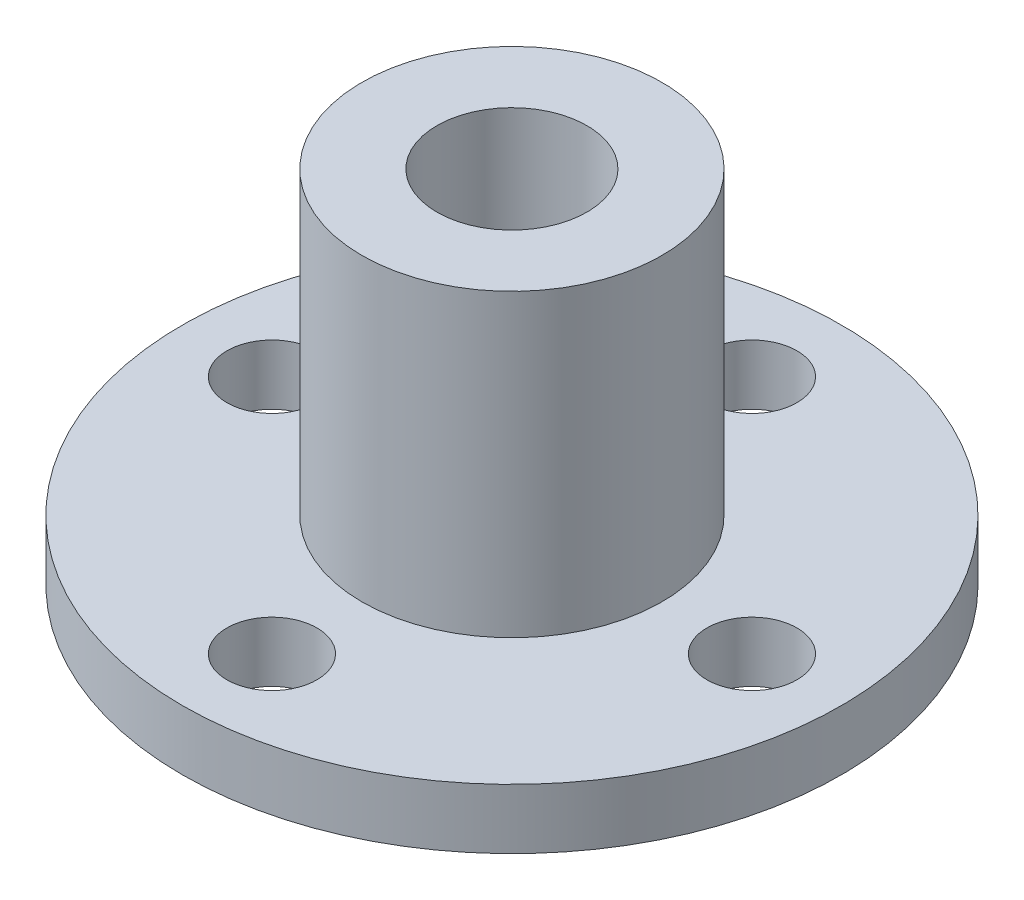
ISO-10303-21;
HEADER;
FILE_DESCRIPTION(('STEP AP214'),'2;1');
FILE_NAME('part.step','',(''),(''),'','','');
FILE_SCHEMA(('AUTOMOTIVE_DESIGN { 1 0 10303 214 1 1 1 1 }'));
ENDSEC;
DATA;
#1=APPLICATION_CONTEXT('core data for automotive mechanical design processes');
#2=APPLICATION_PROTOCOL_DEFINITION('international standard','automotive_design',2000,#1);
#3=PRODUCT_CONTEXT('',#1,'mechanical');
#4=PRODUCT('Part','Part','',(#3));
#5=PRODUCT_RELATED_PRODUCT_CATEGORY('part','',(#4));
#6=PRODUCT_DEFINITION_FORMATION('','',#4);
#7=PRODUCT_DEFINITION_CONTEXT('part definition',#1,'design');
#8=PRODUCT_DEFINITION('design','',#6,#7);
#9=PRODUCT_DEFINITION_SHAPE('','',#8);
#10=(LENGTH_UNIT() NAMED_UNIT(*) SI_UNIT(.MILLI.,.METRE.));
#11=(NAMED_UNIT(*) PLANE_ANGLE_UNIT() SI_UNIT($,.RADIAN.));
#12=(NAMED_UNIT(*) SI_UNIT($,.STERADIAN.) SOLID_ANGLE_UNIT());
#13=UNCERTAINTY_MEASURE_WITH_UNIT(LENGTH_MEASURE(1.E-05),#10,'distance_accuracy_value','');
#14=(GEOMETRIC_REPRESENTATION_CONTEXT(3) GLOBAL_UNCERTAINTY_ASSIGNED_CONTEXT((#13)) GLOBAL_UNIT_ASSIGNED_CONTEXT((#10,
#11,#12)) REPRESENTATION_CONTEXT('',''));
#15=CARTESIAN_POINT('',(0.,0.,0.));
#16=DIRECTION('',(0.,0.,1.));
#17=DIRECTION('',(1.,0.,0.));
#18=AXIS2_PLACEMENT_3D('',#15,#16,#17);
#19=CARTESIAN_POINT('',(0.,2.,0.));
#20=DIRECTION('',(0.,-1.,0.));
#21=DIRECTION('',(0.,0.,-1.));
#22=AXIS2_PLACEMENT_3D('',#19,#20,#21);
#23=CYLINDRICAL_SURFACE('',#22,10.9855);
#24=CARTESIAN_POINT('',(0.,2.,0.));
#25=DIRECTION('',(0.,1.,0.));
#26=DIRECTION('',(0.,0.,1.));
#27=AXIS2_PLACEMENT_3D('',#24,#25,#26);
#28=CIRCLE('',#27,10.9855);
#29=CARTESIAN_POINT('',(0.,2.,10.9855));
#30=VERTEX_POINT('',#29);
#31=EDGE_CURVE('E43',#30,#30,#28,.T.);
#32=ORIENTED_EDGE('',*,*,#31,.F.);
#33=EDGE_LOOP('',(#32));
#34=FACE_BOUND('',#33,.T.);
#35=CARTESIAN_POINT('',(0.,0.,0.));
#36=DIRECTION('',(0.,1.,0.));
#37=DIRECTION('',(0.,0.,1.));
#38=AXIS2_PLACEMENT_3D('',#35,#36,#37);
#39=CIRCLE('',#38,10.9855);
#40=CARTESIAN_POINT('',(0.,0.,10.9855));
#41=VERTEX_POINT('',#40);
#42=EDGE_CURVE('E48',#41,#41,#39,.T.);
#43=ORIENTED_EDGE('',*,*,#42,.T.);
#44=EDGE_LOOP('',(#43));
#45=FACE_BOUND('',#44,.T.);
#46=ADVANCED_FACE('F36',(#34,#45),#23,.T.);
#47=CARTESIAN_POINT('',(0.,2.,0.));
#48=DIRECTION('',(0.,1.,0.));
#49=DIRECTION('',(0.,0.,1.));
#50=AXIS2_PLACEMENT_3D('',#47,#48,#49);
#51=PLANE('',#50);
#52=CARTESIAN_POINT('',(8.,2.,0.));
#53=DIRECTION('',(0.,1.,0.));
#54=DIRECTION('',(0.,0.,1.));
#55=AXIS2_PLACEMENT_3D('',#52,#53,#54);
#56=CIRCLE('',#55,1.5);
#57=CARTESIAN_POINT('',(8.,2.,1.5));
#58=VERTEX_POINT('',#57);
#59=EDGE_CURVE('E60',#58,#58,#56,.T.);
#60=ORIENTED_EDGE('',*,*,#59,.F.);
#61=EDGE_LOOP('',(#60));
#62=FACE_BOUND('',#61,.T.);
#63=CARTESIAN_POINT('',(0.,2.,8.));
#64=DIRECTION('',(0.,1.,0.));
#65=DIRECTION('',(0.,0.,1.));
#66=AXIS2_PLACEMENT_3D('',#63,#64,#65);
#67=CIRCLE('',#66,1.5);
#68=CARTESIAN_POINT('',(0.,2.,9.5));
#69=VERTEX_POINT('',#68);
#70=EDGE_CURVE('E83',#69,#69,#67,.T.);
#71=ORIENTED_EDGE('',*,*,#70,.F.);
#72=EDGE_LOOP('',(#71));
#73=FACE_BOUND('',#72,.T.);
#74=CARTESIAN_POINT('',(-8.,2.,0.));
#75=DIRECTION('',(0.,1.,0.));
#76=DIRECTION('',(0.,0.,1.));
#77=AXIS2_PLACEMENT_3D('',#74,#75,#76);
#78=CIRCLE('',#77,1.5);
#79=CARTESIAN_POINT('',(-8.,2.,1.5));
#80=VERTEX_POINT('',#79);
#81=EDGE_CURVE('E80',#80,#80,#78,.T.);
#82=ORIENTED_EDGE('',*,*,#81,.F.);
#83=EDGE_LOOP('',(#82));
#84=FACE_BOUND('',#83,.T.);
#85=CARTESIAN_POINT('',(0.,2.,-8.));
#86=DIRECTION('',(0.,1.,0.));
#87=DIRECTION('',(0.,0.,1.));
#88=AXIS2_PLACEMENT_3D('',#85,#86,#87);
#89=CIRCLE('',#88,1.5);
#90=CARTESIAN_POINT('',(0.,2.,-6.5));
#91=VERTEX_POINT('',#90);
#92=EDGE_CURVE('E77',#91,#91,#89,.T.);
#93=ORIENTED_EDGE('',*,*,#92,.F.);
#94=EDGE_LOOP('',(#93));
#95=FACE_BOUND('',#94,.T.);
#96=CARTESIAN_POINT('',(0.,2.,0.));
#97=DIRECTION('',(0.,1.,0.));
#98=DIRECTION('',(0.,0.,1.));
#99=AXIS2_PLACEMENT_3D('',#96,#97,#98);
#100=CIRCLE('',#99,5.);
#101=CARTESIAN_POINT('',(0.,2.,5.));
#102=VERTEX_POINT('',#101);
#103=EDGE_CURVE('E10',#102,#102,#100,.T.);
#104=ORIENTED_EDGE('',*,*,#103,.F.);
#105=EDGE_LOOP('',(#104));
#106=FACE_BOUND('',#105,.T.);
#107=ORIENTED_EDGE('',*,*,#31,.T.);
#108=EDGE_LOOP('',(#107));
#109=FACE_BOUND('',#108,.T.);
#110=ADVANCED_FACE('F92',(#62,#73,#84,#95,#106,#109),#51,.T.);
#111=CARTESIAN_POINT('',(0.,0.,0.));
#112=DIRECTION('',(0.,1.,0.));
#113=DIRECTION('',(0.,0.,1.));
#114=AXIS2_PLACEMENT_3D('',#111,#112,#113);
#115=PLANE('',#114);
#116=CARTESIAN_POINT('',(8.,0.,0.));
#117=DIRECTION('',(0.,1.,0.));
#118=DIRECTION('',(0.,0.,1.));
#119=AXIS2_PLACEMENT_3D('',#116,#117,#118);
#120=CIRCLE('',#119,1.5);
#121=CARTESIAN_POINT('',(8.,0.,1.5));
#122=VERTEX_POINT('',#121);
#123=EDGE_CURVE('E39',#122,#122,#120,.T.);
#124=ORIENTED_EDGE('',*,*,#123,.T.);
#125=EDGE_LOOP('',(#124));
#126=FACE_BOUND('',#125,.T.);
#127=CARTESIAN_POINT('',(0.,0.,8.));
#128=DIRECTION('',(0.,1.,0.));
#129=DIRECTION('',(0.,0.,1.));
#130=AXIS2_PLACEMENT_3D('',#127,#128,#129);
#131=CIRCLE('',#130,1.5);
#132=CARTESIAN_POINT('',(0.,0.,9.5));
#133=VERTEX_POINT('',#132);
#134=EDGE_CURVE('E62',#133,#133,#131,.T.);
#135=ORIENTED_EDGE('',*,*,#134,.T.);
#136=EDGE_LOOP('',(#135));
#137=FACE_BOUND('',#136,.T.);
#138=CARTESIAN_POINT('',(-8.,0.,0.));
#139=DIRECTION('',(0.,1.,0.));
#140=DIRECTION('',(0.,0.,1.));
#141=AXIS2_PLACEMENT_3D('',#138,#139,#140);
#142=CIRCLE('',#141,1.5);
#143=CARTESIAN_POINT('',(-8.,0.,1.5));
#144=VERTEX_POINT('',#143);
#145=EDGE_CURVE('E59',#144,#144,#142,.T.);
#146=ORIENTED_EDGE('',*,*,#145,.T.);
#147=EDGE_LOOP('',(#146));
#148=FACE_BOUND('',#147,.T.);
#149=CARTESIAN_POINT('',(0.,0.,-8.));
#150=DIRECTION('',(0.,1.,0.));
#151=DIRECTION('',(0.,0.,1.));
#152=AXIS2_PLACEMENT_3D('',#149,#150,#151);
#153=CIRCLE('',#152,1.5);
#154=CARTESIAN_POINT('',(0.,0.,-6.5));
#155=VERTEX_POINT('',#154);
#156=EDGE_CURVE('E56',#155,#155,#153,.T.);
#157=ORIENTED_EDGE('',*,*,#156,.T.);
#158=EDGE_LOOP('',(#157));
#159=FACE_BOUND('',#158,.T.);
#160=CARTESIAN_POINT('',(0.,0.,0.));
#161=DIRECTION('',(0.,1.,0.));
#162=DIRECTION('',(0.,0.,1.));
#163=AXIS2_PLACEMENT_3D('',#160,#161,#162);
#164=CIRCLE('',#163,2.5);
#165=CARTESIAN_POINT('',(0.,0.,2.5));
#166=VERTEX_POINT('',#165);
#167=EDGE_CURVE('E71',#166,#166,#164,.T.);
#168=ORIENTED_EDGE('',*,*,#167,.T.);
#169=EDGE_LOOP('',(#168));
#170=FACE_BOUND('',#169,.T.);
#171=ORIENTED_EDGE('',*,*,#42,.F.);
#172=EDGE_LOOP('',(#171));
#173=FACE_BOUND('',#172,.T.);
#174=ADVANCED_FACE('F95',(#126,#137,#148,#159,#170,#173),#115,.F.);
#175=CARTESIAN_POINT('',(0.,12.,0.));
#176=DIRECTION('',(0.,-1.,0.));
#177=DIRECTION('',(0.,0.,-1.));
#178=AXIS2_PLACEMENT_3D('',#175,#176,#177);
#179=CYLINDRICAL_SURFACE('',#178,5.);
#180=CARTESIAN_POINT('',(0.,12.,0.));
#181=DIRECTION('',(0.,1.,0.));
#182=DIRECTION('',(0.,0.,1.));
#183=AXIS2_PLACEMENT_3D('',#180,#181,#182);
#184=CIRCLE('',#183,5.);
#185=CARTESIAN_POINT('',(0.,12.,5.));
#186=VERTEX_POINT('',#185);
#187=EDGE_CURVE('E51',#186,#186,#184,.T.);
#188=ORIENTED_EDGE('',*,*,#187,.F.);
#189=EDGE_LOOP('',(#188));
#190=FACE_BOUND('',#189,.T.);
#191=ORIENTED_EDGE('',*,*,#103,.T.);
#192=EDGE_LOOP('',(#191));
#193=FACE_BOUND('',#192,.T.);
#194=ADVANCED_FACE('F111',(#190,#193),#179,.T.);
#195=CARTESIAN_POINT('',(0.,12.,0.));
#196=DIRECTION('',(0.,1.,0.));
#197=DIRECTION('',(0.,0.,1.));
#198=AXIS2_PLACEMENT_3D('',#195,#196,#197);
#199=PLANE('',#198);
#200=CARTESIAN_POINT('',(0.,12.,0.));
#201=DIRECTION('',(0.,1.,0.));
#202=DIRECTION('',(0.,0.,1.));
#203=AXIS2_PLACEMENT_3D('',#200,#201,#202);
#204=CIRCLE('',#203,2.5);
#205=CARTESIAN_POINT('',(0.,12.,2.5));
#206=VERTEX_POINT('',#205);
#207=EDGE_CURVE('E67',#206,#206,#204,.T.);
#208=ORIENTED_EDGE('',*,*,#207,.F.);
#209=EDGE_LOOP('',(#208));
#210=FACE_BOUND('',#209,.T.);
#211=ORIENTED_EDGE('',*,*,#187,.T.);
#212=EDGE_LOOP('',(#211));
#213=FACE_BOUND('',#212,.T.);
#214=ADVANCED_FACE('F115',(#210,#213),#199,.T.);
#215=CARTESIAN_POINT('',(0.,0.,0.));
#216=DIRECTION('',(0.,1.,0.));
#217=DIRECTION('',(0.,0.,1.));
#218=AXIS2_PLACEMENT_3D('',#215,#216,#217);
#219=CYLINDRICAL_SURFACE('',#218,2.5);
#220=ORIENTED_EDGE('',*,*,#167,.F.);
#221=EDGE_LOOP('',(#220));
#222=FACE_BOUND('',#221,.T.);
#223=ORIENTED_EDGE('',*,*,#207,.T.);
#224=EDGE_LOOP('',(#223));
#225=FACE_BOUND('',#224,.T.);
#226=ADVANCED_FACE('F121',(#222,#225),#219,.F.);
#227=CARTESIAN_POINT('',(0.,-8.,-8.));
#228=DIRECTION('',(0.,1.,0.));
#229=DIRECTION('',(0.,0.,1.));
#230=AXIS2_PLACEMENT_3D('',#227,#228,#229);
#231=CYLINDRICAL_SURFACE('',#230,1.5);
#232=ORIENTED_EDGE('',*,*,#92,.T.);
#233=EDGE_LOOP('',(#232));
#234=FACE_BOUND('',#233,.T.);
#235=ORIENTED_EDGE('',*,*,#156,.F.);
#236=EDGE_LOOP('',(#235));
#237=FACE_BOUND('',#236,.T.);
#238=ADVANCED_FACE('F125',(#234,#237),#231,.F.);
#239=CARTESIAN_POINT('',(-8.,-8.,0.));
#240=DIRECTION('',(0.,1.,0.));
#241=DIRECTION('',(0.,0.,1.));
#242=AXIS2_PLACEMENT_3D('',#239,#240,#241);
#243=CYLINDRICAL_SURFACE('',#242,1.5);
#244=ORIENTED_EDGE('',*,*,#81,.T.);
#245=EDGE_LOOP('',(#244));
#246=FACE_BOUND('',#245,.T.);
#247=ORIENTED_EDGE('',*,*,#145,.F.);
#248=EDGE_LOOP('',(#247));
#249=FACE_BOUND('',#248,.T.);
#250=ADVANCED_FACE('F129',(#246,#249),#243,.F.);
#251=CARTESIAN_POINT('',(0.,-8.,8.));
#252=DIRECTION('',(0.,1.,0.));
#253=DIRECTION('',(0.,0.,1.));
#254=AXIS2_PLACEMENT_3D('',#251,#252,#253);
#255=CYLINDRICAL_SURFACE('',#254,1.5);
#256=ORIENTED_EDGE('',*,*,#70,.T.);
#257=EDGE_LOOP('',(#256));
#258=FACE_BOUND('',#257,.T.);
#259=ORIENTED_EDGE('',*,*,#134,.F.);
#260=EDGE_LOOP('',(#259));
#261=FACE_BOUND('',#260,.T.);
#262=ADVANCED_FACE('F133',(#258,#261),#255,.F.);
#263=CARTESIAN_POINT('',(8.,-8.,0.));
#264=DIRECTION('',(0.,1.,0.));
#265=DIRECTION('',(0.,0.,1.));
#266=AXIS2_PLACEMENT_3D('',#263,#264,#265);
#267=CYLINDRICAL_SURFACE('',#266,1.5);
#268=ORIENTED_EDGE('',*,*,#59,.T.);
#269=EDGE_LOOP('',(#268));
#270=FACE_BOUND('',#269,.T.);
#271=ORIENTED_EDGE('',*,*,#123,.F.);
#272=EDGE_LOOP('',(#271));
#273=FACE_BOUND('',#272,.T.);
#274=ADVANCED_FACE('F89',(#270,#273),#267,.F.);
#275=CLOSED_SHELL('',(#46,#110,#174,#194,#214,#226,#238,#250,#262,#274));
#276=MANIFOLD_SOLID_BREP('B2',#275);
#277=ADVANCED_BREP_SHAPE_REPRESENTATION('',(#18,#276),#14);
#278=SHAPE_DEFINITION_REPRESENTATION(#9,#277);
ENDSEC;
END-ISO-10303-21;
